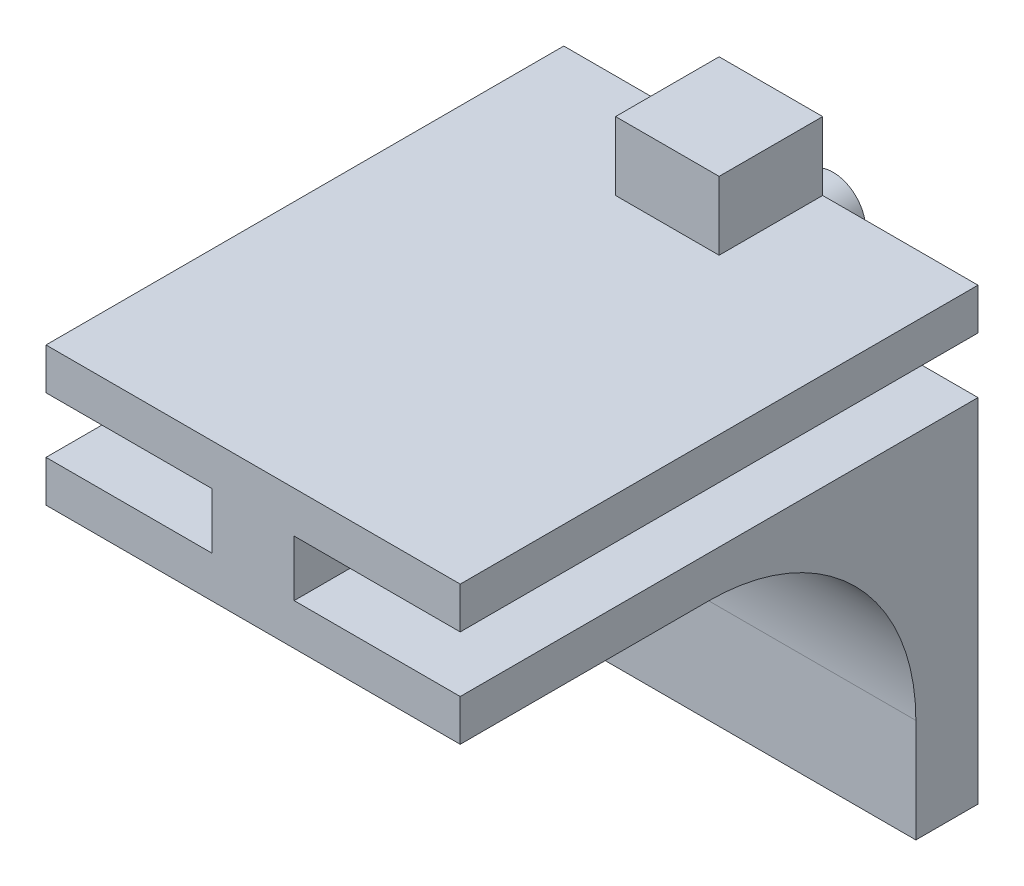
ISO-10303-21;
HEADER;
FILE_DESCRIPTION(('STEP AP214'),'2;1');
FILE_NAME('part.step','',(''),(''),'','','');
FILE_SCHEMA(('AUTOMOTIVE_DESIGN { 1 0 10303 214 1 1 1 1 }'));
ENDSEC;
DATA;
#1=APPLICATION_CONTEXT('core data for automotive mechanical design processes');
#2=APPLICATION_PROTOCOL_DEFINITION('international standard','automotive_design',2000,#1);
#3=PRODUCT_CONTEXT('',#1,'mechanical');
#4=PRODUCT('Part','Part','',(#3));
#5=PRODUCT_RELATED_PRODUCT_CATEGORY('part','',(#4));
#6=PRODUCT_DEFINITION_FORMATION('','',#4);
#7=PRODUCT_DEFINITION_CONTEXT('part definition',#1,'design');
#8=PRODUCT_DEFINITION('design','',#6,#7);
#9=PRODUCT_DEFINITION_SHAPE('','',#8);
#10=(LENGTH_UNIT() NAMED_UNIT(*) SI_UNIT(.MILLI.,.METRE.));
#11=(NAMED_UNIT(*) PLANE_ANGLE_UNIT() SI_UNIT($,.RADIAN.));
#12=(NAMED_UNIT(*) SI_UNIT($,.STERADIAN.) SOLID_ANGLE_UNIT());
#13=UNCERTAINTY_MEASURE_WITH_UNIT(LENGTH_MEASURE(1.E-05),#10,'distance_accuracy_value','');
#14=(GEOMETRIC_REPRESENTATION_CONTEXT(3) GLOBAL_UNCERTAINTY_ASSIGNED_CONTEXT((#13)) GLOBAL_UNIT_ASSIGNED_CONTEXT((#10,
#11,#12)) REPRESENTATION_CONTEXT('',''));
#15=CARTESIAN_POINT('',(0.,0.,0.));
#16=DIRECTION('',(0.,0.,1.));
#17=DIRECTION('',(1.,0.,0.));
#18=AXIS2_PLACEMENT_3D('',#15,#16,#17);
#19=CARTESIAN_POINT('',(10.,3.35,25.));
#20=DIRECTION('',(0.,-1.,0.));
#21=DIRECTION('',(0.,0.,-1.));
#22=AXIS2_PLACEMENT_3D('',#19,#20,#21);
#23=PLANE('',#22);
#24=DIRECTION('',(0.,0.,-1.));
#25=VECTOR('',#24,1.);
#26=CARTESIAN_POINT('',(2.5,3.35,5.));
#27=LINE('',#26,#25);
#28=CARTESIAN_POINT('',(2.5,3.35,5.));
#29=VERTEX_POINT('',#28);
#30=CARTESIAN_POINT('',(2.5,3.35,0.));
#31=VERTEX_POINT('',#30);
#32=EDGE_CURVE('E37',#29,#31,#27,.T.);
#33=ORIENTED_EDGE('',*,*,#32,.F.);
#34=DIRECTION('',(1.,0.,0.));
#35=VECTOR('',#34,1.);
#36=CARTESIAN_POINT('',(-2.5,3.35,5.));
#37=LINE('',#36,#35);
#38=CARTESIAN_POINT('',(-2.5,3.35,5.));
#39=VERTEX_POINT('',#38);
#40=EDGE_CURVE('E186',#39,#29,#37,.T.);
#41=ORIENTED_EDGE('',*,*,#40,.F.);
#42=DIRECTION('',(0.,0.,1.));
#43=VECTOR('',#42,1.);
#44=CARTESIAN_POINT('',(-2.5,3.35,5.));
#45=LINE('',#44,#43);
#46=CARTESIAN_POINT('',(-2.5,3.35,0.));
#47=VERTEX_POINT('',#46);
#48=EDGE_CURVE('E56',#47,#39,#45,.T.);
#49=ORIENTED_EDGE('',*,*,#48,.F.);
#50=DIRECTION('',(-1.,0.,0.));
#51=VECTOR('',#50,1.);
#52=CARTESIAN_POINT('',(10.,3.35,0.));
#53=LINE('',#52,#51);
#54=CARTESIAN_POINT('',(-10.,3.35,0.));
#55=VERTEX_POINT('',#54);
#56=EDGE_CURVE('E203',#47,#55,#53,.T.);
#57=ORIENTED_EDGE('',*,*,#56,.T.);
#58=DIRECTION('',(0.,0.,-1.));
#59=VECTOR('',#58,1.);
#60=CARTESIAN_POINT('',(-10.,3.35,25.));
#61=LINE('',#60,#59);
#62=CARTESIAN_POINT('',(-10.,3.35,25.));
#63=VERTEX_POINT('',#62);
#64=EDGE_CURVE('E235',#63,#55,#61,.T.);
#65=ORIENTED_EDGE('',*,*,#64,.F.);
#66=DIRECTION('',(-1.,0.,0.));
#67=VECTOR('',#66,1.);
#68=CARTESIAN_POINT('',(10.,3.35,25.));
#69=LINE('',#68,#67);
#70=CARTESIAN_POINT('',(10.,3.35,25.));
#71=VERTEX_POINT('',#70);
#72=EDGE_CURVE('E325',#71,#63,#69,.T.);
#73=ORIENTED_EDGE('',*,*,#72,.F.);
#74=DIRECTION('',(0.,0.,-1.));
#75=VECTOR('',#74,1.);
#76=CARTESIAN_POINT('',(10.,3.35,25.));
#77=LINE('',#76,#75);
#78=CARTESIAN_POINT('',(10.,3.35,0.));
#79=VERTEX_POINT('',#78);
#80=EDGE_CURVE('E238',#71,#79,#77,.T.);
#81=ORIENTED_EDGE('',*,*,#80,.T.);
#82=EDGE_CURVE('E206',#79,#31,#53,.T.);
#83=ORIENTED_EDGE('',*,*,#82,.T.);
#84=EDGE_LOOP('',(#33,#41,#49,#57,#65,#73,#81,#83));
#85=FACE_BOUND('',#84,.T.);
#86=ADVANCED_FACE('F33',(#85),#23,.F.);
#87=CARTESIAN_POINT('',(0.,0.,0.));
#88=DIRECTION('',(0.,0.,-1.));
#89=DIRECTION('',(-1.,0.,0.));
#90=AXIS2_PLACEMENT_3D('',#87,#88,#89);
#91=PLANE('',#90);
#92=DIRECTION('',(0.,-1.,0.));
#93=VECTOR('',#92,1.);
#94=CARTESIAN_POINT('',(-10.,-3.35,0.));
#95=LINE('',#94,#93);
#96=CARTESIAN_POINT('',(-10.,-1.35,0.));
#97=VERTEX_POINT('',#96);
#98=CARTESIAN_POINT('',(-10.,-18.35,0.));
#99=VERTEX_POINT('',#98);
#100=EDGE_CURVE('E273',#97,#99,#95,.T.);
#101=ORIENTED_EDGE('',*,*,#100,.F.);
#102=DIRECTION('',(-1.,0.,0.));
#103=VECTOR('',#102,1.);
#104=CARTESIAN_POINT('',(-10.,-1.35,0.));
#105=LINE('',#104,#103);
#106=CARTESIAN_POINT('',(-1.9812,-1.35,0.));
#107=VERTEX_POINT('',#106);
#108=EDGE_CURVE('E219',#107,#97,#105,.T.);
#109=ORIENTED_EDGE('',*,*,#108,.F.);
#110=DIRECTION('',(0.,-1.,0.));
#111=VECTOR('',#110,1.);
#112=CARTESIAN_POINT('',(-1.9812,-1.35,0.));
#113=LINE('',#112,#111);
#114=CARTESIAN_POINT('',(-1.9812,1.35,0.));
#115=VERTEX_POINT('',#114);
#116=EDGE_CURVE('E217',#115,#107,#113,.T.);
#117=ORIENTED_EDGE('',*,*,#116,.F.);
#118=DIRECTION('',(1.,0.,0.));
#119=VECTOR('',#118,1.);
#120=CARTESIAN_POINT('',(-10.,1.35,0.));
#121=LINE('',#120,#119);
#122=CARTESIAN_POINT('',(-10.,1.35,0.));
#123=VERTEX_POINT('',#122);
#124=EDGE_CURVE('E215',#123,#115,#121,.T.);
#125=ORIENTED_EDGE('',*,*,#124,.F.);
#126=DIRECTION('',(0.,-1.,0.));
#127=VECTOR('',#126,1.);
#128=CARTESIAN_POINT('',(-10.,3.35,0.));
#129=LINE('',#128,#127);
#130=EDGE_CURVE('E212',#55,#123,#129,.T.);
#131=ORIENTED_EDGE('',*,*,#130,.F.);
#132=ORIENTED_EDGE('',*,*,#56,.F.);
#133=DIRECTION('',(0.,-1.,0.));
#134=VECTOR('',#133,1.);
#135=CARTESIAN_POINT('',(-2.5,6.65,0.));
#136=LINE('',#135,#134);
#137=CARTESIAN_POINT('',(-2.5,6.65,0.));
#138=VERTEX_POINT('',#137);
#139=EDGE_CURVE('E173',#138,#47,#136,.T.);
#140=ORIENTED_EDGE('',*,*,#139,.F.);
#141=DIRECTION('',(-1.,0.,0.));
#142=VECTOR('',#141,1.);
#143=CARTESIAN_POINT('',(-2.5,6.65,0.));
#144=LINE('',#143,#142);
#145=CARTESIAN_POINT('',(2.5,6.65,0.));
#146=VERTEX_POINT('',#145);
#147=EDGE_CURVE('E164',#146,#138,#144,.T.);
#148=ORIENTED_EDGE('',*,*,#147,.F.);
#149=DIRECTION('',(0.,-1.,0.));
#150=VECTOR('',#149,1.);
#151=CARTESIAN_POINT('',(2.5,6.65,0.));
#152=LINE('',#151,#150);
#153=EDGE_CURVE('E171',#146,#31,#152,.T.);
#154=ORIENTED_EDGE('',*,*,#153,.T.);
#155=ORIENTED_EDGE('',*,*,#82,.F.);
#156=DIRECTION('',(0.,1.,0.));
#157=VECTOR('',#156,1.);
#158=CARTESIAN_POINT('',(10.,3.35,0.));
#159=LINE('',#158,#157);
#160=CARTESIAN_POINT('',(10.,1.35,0.));
#161=VERTEX_POINT('',#160);
#162=EDGE_CURVE('E207',#161,#79,#159,.T.);
#163=ORIENTED_EDGE('',*,*,#162,.F.);
#164=DIRECTION('',(1.,0.,0.));
#165=VECTOR('',#164,1.);
#166=CARTESIAN_POINT('',(10.,1.35,0.));
#167=LINE('',#166,#165);
#168=CARTESIAN_POINT('',(1.9812,1.35,0.));
#169=VERTEX_POINT('',#168);
#170=EDGE_CURVE('E340',#169,#161,#167,.T.);
#171=ORIENTED_EDGE('',*,*,#170,.F.);
#172=DIRECTION('',(0.,1.,0.));
#173=VECTOR('',#172,1.);
#174=CARTESIAN_POINT('',(1.9812,-1.35,0.));
#175=LINE('',#174,#173);
#176=CARTESIAN_POINT('',(1.9812,-1.35,0.));
#177=VERTEX_POINT('',#176);
#178=EDGE_CURVE('E339',#177,#169,#175,.T.);
#179=ORIENTED_EDGE('',*,*,#178,.F.);
#180=DIRECTION('',(-1.,0.,0.));
#181=VECTOR('',#180,1.);
#182=CARTESIAN_POINT('',(10.,-1.35,0.));
#183=LINE('',#182,#181);
#184=CARTESIAN_POINT('',(10.,-1.35,0.));
#185=VERTEX_POINT('',#184);
#186=EDGE_CURVE('E337',#185,#177,#183,.T.);
#187=ORIENTED_EDGE('',*,*,#186,.F.);
#188=DIRECTION('',(0.,1.,0.));
#189=VECTOR('',#188,1.);
#190=CARTESIAN_POINT('',(10.,-3.35,0.));
#191=LINE('',#190,#189);
#192=CARTESIAN_POINT('',(10.,-18.35,0.));
#193=VERTEX_POINT('',#192);
#194=EDGE_CURVE('E335',#193,#185,#191,.T.);
#195=ORIENTED_EDGE('',*,*,#194,.F.);
#196=DIRECTION('',(1.,0.,0.));
#197=VECTOR('',#196,1.);
#198=CARTESIAN_POINT('',(10.,-18.35,0.));
#199=LINE('',#198,#197);
#200=EDGE_CURVE('E309',#99,#193,#199,.T.);
#201=ORIENTED_EDGE('',*,*,#200,.F.);
#202=EDGE_LOOP('',(#101,#109,#117,#125,#131,#132,#140,#148,#154,#155,#163,#171,#179,#187,#195,#201));
#203=FACE_BOUND('',#202,.T.);
#204=CARTESIAN_POINT('',(0.,0.,0.));
#205=DIRECTION('',(0.,0.,-1.));
#206=DIRECTION('',(-1.,0.,0.));
#207=AXIS2_PLACEMENT_3D('',#204,#205,#206);
#208=CIRCLE('',#207,1.5748);
#209=CARTESIAN_POINT('',(-1.5748,0.,0.));
#210=VERTEX_POINT('',#209);
#211=EDGE_CURVE('E189',#210,#210,#208,.T.);
#212=ORIENTED_EDGE('',*,*,#211,.F.);
#213=EDGE_LOOP('',(#212));
#214=FACE_BOUND('',#213,.T.);
#215=ADVANCED_FACE('F167',(#203,#214),#91,.T.);
#216=CARTESIAN_POINT('',(10.,-3.35,25.));
#217=DIRECTION('',(0.,1.,0.));
#218=DIRECTION('',(0.,0.,1.));
#219=AXIS2_PLACEMENT_3D('',#216,#217,#218);
#220=PLANE('',#219);
#221=DIRECTION('',(0.,0.,-1.));
#222=VECTOR('',#221,1.);
#223=CARTESIAN_POINT('',(-10.,-3.35,25.));
#224=LINE('',#223,#222);
#225=CARTESIAN_POINT('',(-10.,-3.35,25.));
#226=VERTEX_POINT('',#225);
#227=CARTESIAN_POINT('',(-10.,-3.35,13.));
#228=VERTEX_POINT('',#227);
#229=EDGE_CURVE('E260',#226,#228,#224,.T.);
#230=ORIENTED_EDGE('',*,*,#229,.T.);
#231=DIRECTION('',(-1.,0.,0.));
#232=VECTOR('',#231,1.);
#233=CARTESIAN_POINT('',(10.,-3.35,13.));
#234=LINE('',#233,#232);
#235=CARTESIAN_POINT('',(10.,-3.35,13.));
#236=VERTEX_POINT('',#235);
#237=EDGE_CURVE('E278',#228,#236,#234,.F.);
#238=ORIENTED_EDGE('',*,*,#237,.T.);
#239=DIRECTION('',(0.,0.,-1.));
#240=VECTOR('',#239,1.);
#241=CARTESIAN_POINT('',(10.,-3.35,25.));
#242=LINE('',#241,#240);
#243=CARTESIAN_POINT('',(10.,-3.35,25.));
#244=VERTEX_POINT('',#243);
#245=EDGE_CURVE('E253',#244,#236,#242,.T.);
#246=ORIENTED_EDGE('',*,*,#245,.F.);
#247=DIRECTION('',(1.,0.,0.));
#248=VECTOR('',#247,1.);
#249=CARTESIAN_POINT('',(10.,-3.35,25.));
#250=LINE('',#249,#248);
#251=EDGE_CURVE('E292',#226,#244,#250,.T.);
#252=ORIENTED_EDGE('',*,*,#251,.F.);
#253=EDGE_LOOP('',(#230,#238,#246,#252));
#254=FACE_BOUND('',#253,.T.);
#255=ADVANCED_FACE('F290',(#254),#220,.F.);
#256=CARTESIAN_POINT('',(-10.,-3.35,25.));
#257=DIRECTION('',(1.,0.,0.));
#258=DIRECTION('',(0.,0.,-1.));
#259=AXIS2_PLACEMENT_3D('',#256,#257,#258);
#260=PLANE('',#259);
#261=ORIENTED_EDGE('',*,*,#100,.T.);
#262=DIRECTION('',(0.,0.,-1.));
#263=VECTOR('',#262,1.);
#264=CARTESIAN_POINT('',(-10.,-18.35,0.));
#265=LINE('',#264,#263);
#266=CARTESIAN_POINT('',(-10.,-18.35,3.));
#267=VERTEX_POINT('',#266);
#268=EDGE_CURVE('E268',#267,#99,#265,.T.);
#269=ORIENTED_EDGE('',*,*,#268,.F.);
#270=DIRECTION('',(0.,1.,0.));
#271=VECTOR('',#270,1.);
#272=CARTESIAN_POINT('',(-10.,-18.35,3.));
#273=LINE('',#272,#271);
#274=CARTESIAN_POINT('',(-10.,-13.35,3.));
#275=VERTEX_POINT('',#274);
#276=EDGE_CURVE('E264',#267,#275,#273,.T.);
#277=ORIENTED_EDGE('',*,*,#276,.T.);
#278=CARTESIAN_POINT('',(-10.,-13.35,13.));
#279=DIRECTION('',(1.,0.,0.));
#280=DIRECTION('',(0.,0.,-1.));
#281=AXIS2_PLACEMENT_3D('',#278,#279,#280);
#282=CIRCLE('',#281,10.);
#283=EDGE_CURVE('E43',#275,#228,#282,.T.);
#284=ORIENTED_EDGE('',*,*,#283,.T.);
#285=ORIENTED_EDGE('',*,*,#229,.F.);
#286=DIRECTION('',(0.,-1.,0.));
#287=VECTOR('',#286,1.);
#288=CARTESIAN_POINT('',(-10.,-3.35,25.));
#289=LINE('',#288,#287);
#290=CARTESIAN_POINT('',(-10.,-1.35,25.));
#291=VERTEX_POINT('',#290);
#292=EDGE_CURVE('E221',#291,#226,#289,.T.);
#293=ORIENTED_EDGE('',*,*,#292,.F.);
#294=DIRECTION('',(0.,0.,-1.));
#295=VECTOR('',#294,1.);
#296=CARTESIAN_POINT('',(-10.,-1.35,25.));
#297=LINE('',#296,#295);
#298=EDGE_CURVE('E222',#291,#97,#297,.T.);
#299=ORIENTED_EDGE('',*,*,#298,.T.);
#300=EDGE_LOOP('',(#261,#269,#277,#284,#285,#293,#299));
#301=FACE_BOUND('',#300,.T.);
#302=ADVANCED_FACE('F282',(#301),#260,.F.);
#303=CARTESIAN_POINT('',(10.,-3.35,25.));
#304=DIRECTION('',(-1.,0.,0.));
#305=DIRECTION('',(0.,-1.,0.));
#306=AXIS2_PLACEMENT_3D('',#303,#304,#305);
#307=PLANE('',#306);
#308=ORIENTED_EDGE('',*,*,#194,.T.);
#309=DIRECTION('',(0.,0.,-1.));
#310=VECTOR('',#309,1.);
#311=CARTESIAN_POINT('',(10.,-1.35,25.));
#312=LINE('',#311,#310);
#313=CARTESIAN_POINT('',(10.,-1.35,25.));
#314=VERTEX_POINT('',#313);
#315=EDGE_CURVE('E250',#314,#185,#312,.T.);
#316=ORIENTED_EDGE('',*,*,#315,.F.);
#317=DIRECTION('',(0.,1.,0.));
#318=VECTOR('',#317,1.);
#319=CARTESIAN_POINT('',(10.,-3.35,25.));
#320=LINE('',#319,#318);
#321=EDGE_CURVE('E315',#244,#314,#320,.T.);
#322=ORIENTED_EDGE('',*,*,#321,.F.);
#323=ORIENTED_EDGE('',*,*,#245,.T.);
#324=CARTESIAN_POINT('',(9.99999999999997,-13.35,13.));
#325=DIRECTION('',(-1.,0.,0.));
#326=DIRECTION('',(0.,-1.,0.));
#327=AXIS2_PLACEMENT_3D('',#324,#325,#326);
#328=CIRCLE('',#327,10.);
#329=CARTESIAN_POINT('',(10.,-13.35,3.));
#330=VERTEX_POINT('',#329);
#331=EDGE_CURVE('E11',#236,#330,#328,.T.);
#332=ORIENTED_EDGE('',*,*,#331,.T.);
#333=DIRECTION('',(0.,1.,0.));
#334=VECTOR('',#333,1.);
#335=CARTESIAN_POINT('',(10.,-18.35,3.));
#336=LINE('',#335,#334);
#337=CARTESIAN_POINT('',(10.,-18.35,3.));
#338=VERTEX_POINT('',#337);
#339=EDGE_CURVE('E267',#338,#330,#336,.T.);
#340=ORIENTED_EDGE('',*,*,#339,.F.);
#341=DIRECTION('',(0.,0.,1.));
#342=VECTOR('',#341,1.);
#343=CARTESIAN_POINT('',(10.,-18.35,3.));
#344=LINE('',#343,#342);
#345=EDGE_CURVE('E306',#193,#338,#344,.T.);
#346=ORIENTED_EDGE('',*,*,#345,.F.);
#347=EDGE_LOOP('',(#308,#316,#322,#323,#332,#340,#346));
#348=FACE_BOUND('',#347,.T.);
#349=ADVANCED_FACE('F297',(#348),#307,.F.);
#350=CARTESIAN_POINT('',(10.,-1.35,25.));
#351=DIRECTION('',(0.,-1.,0.));
#352=DIRECTION('',(1.,0.,0.));
#353=AXIS2_PLACEMENT_3D('',#350,#351,#352);
#354=PLANE('',#353);
#355=ORIENTED_EDGE('',*,*,#186,.T.);
#356=DIRECTION('',(0.,0.,-1.));
#357=VECTOR('',#356,1.);
#358=CARTESIAN_POINT('',(1.9812,-1.35,25.));
#359=LINE('',#358,#357);
#360=CARTESIAN_POINT('',(1.9812,-1.35,25.));
#361=VERTEX_POINT('',#360);
#362=EDGE_CURVE('E247',#361,#177,#359,.T.);
#363=ORIENTED_EDGE('',*,*,#362,.F.);
#364=DIRECTION('',(-1.,0.,0.));
#365=VECTOR('',#364,1.);
#366=CARTESIAN_POINT('',(10.,-1.35,25.));
#367=LINE('',#366,#365);
#368=EDGE_CURVE('E317',#314,#361,#367,.T.);
#369=ORIENTED_EDGE('',*,*,#368,.F.);
#370=ORIENTED_EDGE('',*,*,#315,.T.);
#371=EDGE_LOOP('',(#355,#363,#369,#370));
#372=FACE_BOUND('',#371,.T.);
#373=ADVANCED_FACE('F368',(#372),#354,.F.);
#374=CARTESIAN_POINT('',(1.9812,-1.35,25.));
#375=DIRECTION('',(-1.,0.,0.));
#376=DIRECTION('',(0.,0.,1.));
#377=AXIS2_PLACEMENT_3D('',#374,#375,#376);
#378=PLANE('',#377);
#379=ORIENTED_EDGE('',*,*,#178,.T.);
#380=DIRECTION('',(0.,0.,-1.));
#381=VECTOR('',#380,1.);
#382=CARTESIAN_POINT('',(1.9812,1.35,25.));
#383=LINE('',#382,#381);
#384=CARTESIAN_POINT('',(1.9812,1.35,25.));
#385=VERTEX_POINT('',#384);
#386=EDGE_CURVE('E244',#385,#169,#383,.T.);
#387=ORIENTED_EDGE('',*,*,#386,.F.);
#388=DIRECTION('',(0.,1.,0.));
#389=VECTOR('',#388,1.);
#390=CARTESIAN_POINT('',(1.9812,-1.35,25.));
#391=LINE('',#390,#389);
#392=EDGE_CURVE('E319',#361,#385,#391,.T.);
#393=ORIENTED_EDGE('',*,*,#392,.F.);
#394=ORIENTED_EDGE('',*,*,#362,.T.);
#395=EDGE_LOOP('',(#379,#387,#393,#394));
#396=FACE_BOUND('',#395,.T.);
#397=ADVANCED_FACE('F360',(#396),#378,.F.);
#398=CARTESIAN_POINT('',(10.,1.35,25.));
#399=DIRECTION('',(0.,1.,0.));
#400=DIRECTION('',(-1.,0.,0.));
#401=AXIS2_PLACEMENT_3D('',#398,#399,#400);
#402=PLANE('',#401);
#403=ORIENTED_EDGE('',*,*,#170,.T.);
#404=DIRECTION('',(0.,0.,-1.));
#405=VECTOR('',#404,1.);
#406=CARTESIAN_POINT('',(10.,1.35,25.));
#407=LINE('',#406,#405);
#408=CARTESIAN_POINT('',(10.,1.35,25.));
#409=VERTEX_POINT('',#408);
#410=EDGE_CURVE('E241',#409,#161,#407,.T.);
#411=ORIENTED_EDGE('',*,*,#410,.F.);
#412=DIRECTION('',(1.,0.,0.));
#413=VECTOR('',#412,1.);
#414=CARTESIAN_POINT('',(10.,1.35,25.));
#415=LINE('',#414,#413);
#416=EDGE_CURVE('E321',#385,#409,#415,.T.);
#417=ORIENTED_EDGE('',*,*,#416,.F.);
#418=ORIENTED_EDGE('',*,*,#386,.T.);
#419=EDGE_LOOP('',(#403,#411,#417,#418));
#420=FACE_BOUND('',#419,.T.);
#421=ADVANCED_FACE('F358',(#420),#402,.F.);
#422=CARTESIAN_POINT('',(10.,3.35,25.));
#423=DIRECTION('',(-1.,0.,0.));
#424=DIRECTION('',(0.,-1.,0.));
#425=AXIS2_PLACEMENT_3D('',#422,#423,#424);
#426=PLANE('',#425);
#427=ORIENTED_EDGE('',*,*,#162,.T.);
#428=ORIENTED_EDGE('',*,*,#80,.F.);
#429=DIRECTION('',(0.,1.,0.));
#430=VECTOR('',#429,1.);
#431=CARTESIAN_POINT('',(10.,3.35,25.));
#432=LINE('',#431,#430);
#433=EDGE_CURVE('E323',#409,#71,#432,.T.);
#434=ORIENTED_EDGE('',*,*,#433,.F.);
#435=ORIENTED_EDGE('',*,*,#410,.T.);
#436=EDGE_LOOP('',(#427,#428,#434,#435));
#437=FACE_BOUND('',#436,.T.);
#438=ADVANCED_FACE('F347',(#437),#426,.F.);
#439=CARTESIAN_POINT('',(-10.,3.35,25.));
#440=DIRECTION('',(1.,0.,0.));
#441=DIRECTION('',(0.,0.,-1.));
#442=AXIS2_PLACEMENT_3D('',#439,#440,#441);
#443=PLANE('',#442);
#444=ORIENTED_EDGE('',*,*,#130,.T.);
#445=DIRECTION('',(0.,0.,-1.));
#446=VECTOR('',#445,1.);
#447=CARTESIAN_POINT('',(-10.,1.35,25.));
#448=LINE('',#447,#446);
#449=CARTESIAN_POINT('',(-10.,1.35,25.));
#450=VERTEX_POINT('',#449);
#451=EDGE_CURVE('E232',#450,#123,#448,.T.);
#452=ORIENTED_EDGE('',*,*,#451,.F.);
#453=DIRECTION('',(0.,-1.,0.));
#454=VECTOR('',#453,1.);
#455=CARTESIAN_POINT('',(-10.,3.35,25.));
#456=LINE('',#455,#454);
#457=EDGE_CURVE('E327',#63,#450,#456,.T.);
#458=ORIENTED_EDGE('',*,*,#457,.F.);
#459=ORIENTED_EDGE('',*,*,#64,.T.);
#460=EDGE_LOOP('',(#444,#452,#458,#459));
#461=FACE_BOUND('',#460,.T.);
#462=ADVANCED_FACE('F366',(#461),#443,.F.);
#463=CARTESIAN_POINT('',(-10.,1.35,25.));
#464=DIRECTION('',(0.,1.,0.));
#465=DIRECTION('',(0.,0.,1.));
#466=AXIS2_PLACEMENT_3D('',#463,#464,#465);
#467=PLANE('',#466);
#468=ORIENTED_EDGE('',*,*,#124,.T.);
#469=DIRECTION('',(0.,0.,-1.));
#470=VECTOR('',#469,1.);
#471=CARTESIAN_POINT('',(-1.9812,1.35,25.));
#472=LINE('',#471,#470);
#473=CARTESIAN_POINT('',(-1.9812,1.35,25.));
#474=VERTEX_POINT('',#473);
#475=EDGE_CURVE('E229',#474,#115,#472,.T.);
#476=ORIENTED_EDGE('',*,*,#475,.F.);
#477=DIRECTION('',(1.,0.,0.));
#478=VECTOR('',#477,1.);
#479=CARTESIAN_POINT('',(-10.,1.35,25.));
#480=LINE('',#479,#478);
#481=EDGE_CURVE('E329',#450,#474,#480,.T.);
#482=ORIENTED_EDGE('',*,*,#481,.F.);
#483=ORIENTED_EDGE('',*,*,#451,.T.);
#484=EDGE_LOOP('',(#468,#476,#482,#483));
#485=FACE_BOUND('',#484,.T.);
#486=ADVANCED_FACE('F382',(#485),#467,.F.);
#487=CARTESIAN_POINT('',(-1.9812,-1.35,25.));
#488=DIRECTION('',(1.,0.,0.));
#489=DIRECTION('',(0.,0.,-1.));
#490=AXIS2_PLACEMENT_3D('',#487,#488,#489);
#491=PLANE('',#490);
#492=ORIENTED_EDGE('',*,*,#116,.T.);
#493=DIRECTION('',(0.,0.,-1.));
#494=VECTOR('',#493,1.);
#495=CARTESIAN_POINT('',(-1.9812,-1.35,25.));
#496=LINE('',#495,#494);
#497=CARTESIAN_POINT('',(-1.9812,-1.35,25.));
#498=VERTEX_POINT('',#497);
#499=EDGE_CURVE('E225',#498,#107,#496,.T.);
#500=ORIENTED_EDGE('',*,*,#499,.F.);
#501=DIRECTION('',(0.,-1.,0.));
#502=VECTOR('',#501,1.);
#503=CARTESIAN_POINT('',(-1.9812,-1.35,25.));
#504=LINE('',#503,#502);
#505=EDGE_CURVE('E331',#474,#498,#504,.T.);
#506=ORIENTED_EDGE('',*,*,#505,.F.);
#507=ORIENTED_EDGE('',*,*,#475,.T.);
#508=EDGE_LOOP('',(#492,#500,#506,#507));
#509=FACE_BOUND('',#508,.T.);
#510=ADVANCED_FACE('F386',(#509),#491,.F.);
#511=CARTESIAN_POINT('',(-10.,-1.35,25.));
#512=DIRECTION('',(0.,-1.,0.));
#513=DIRECTION('',(0.,0.,-1.));
#514=AXIS2_PLACEMENT_3D('',#511,#512,#513);
#515=PLANE('',#514);
#516=ORIENTED_EDGE('',*,*,#108,.T.);
#517=ORIENTED_EDGE('',*,*,#298,.F.);
#518=DIRECTION('',(-1.,0.,0.));
#519=VECTOR('',#518,1.);
#520=CARTESIAN_POINT('',(-10.,-1.35,25.));
#521=LINE('',#520,#519);
#522=EDGE_CURVE('E226',#498,#291,#521,.T.);
#523=ORIENTED_EDGE('',*,*,#522,.F.);
#524=ORIENTED_EDGE('',*,*,#499,.T.);
#525=EDGE_LOOP('',(#516,#517,#523,#524));
#526=FACE_BOUND('',#525,.T.);
#527=ADVANCED_FACE('F390',(#526),#515,.F.);
#528=CARTESIAN_POINT('',(0.,0.,25.));
#529=DIRECTION('',(0.,0.,-1.));
#530=DIRECTION('',(-1.,0.,0.));
#531=AXIS2_PLACEMENT_3D('',#528,#529,#530);
#532=PLANE('',#531);
#533=ORIENTED_EDGE('',*,*,#292,.T.);
#534=ORIENTED_EDGE('',*,*,#251,.T.);
#535=ORIENTED_EDGE('',*,*,#321,.T.);
#536=ORIENTED_EDGE('',*,*,#368,.T.);
#537=ORIENTED_EDGE('',*,*,#392,.T.);
#538=ORIENTED_EDGE('',*,*,#416,.T.);
#539=ORIENTED_EDGE('',*,*,#433,.T.);
#540=ORIENTED_EDGE('',*,*,#72,.T.);
#541=ORIENTED_EDGE('',*,*,#457,.T.);
#542=ORIENTED_EDGE('',*,*,#481,.T.);
#543=ORIENTED_EDGE('',*,*,#505,.T.);
#544=ORIENTED_EDGE('',*,*,#522,.T.);
#545=EDGE_LOOP('',(#533,#534,#535,#536,#537,#538,#539,#540,#541,#542,#543,#544));
#546=FACE_BOUND('',#545,.T.);
#547=ADVANCED_FACE('F353',(#546),#532,.F.);
#548=CARTESIAN_POINT('',(-10.,-18.35,3.));
#549=DIRECTION('',(0.,0.,-1.));
#550=DIRECTION('',(-1.,0.,0.));
#551=AXIS2_PLACEMENT_3D('',#548,#549,#550);
#552=PLANE('',#551);
#553=ORIENTED_EDGE('',*,*,#339,.T.);
#554=DIRECTION('',(-1.,0.,0.));
#555=VECTOR('',#554,1.);
#556=CARTESIAN_POINT('',(-10.,-13.35,3.));
#557=LINE('',#556,#555);
#558=EDGE_CURVE('E263',#330,#275,#557,.T.);
#559=ORIENTED_EDGE('',*,*,#558,.T.);
#560=ORIENTED_EDGE('',*,*,#276,.F.);
#561=DIRECTION('',(-1.,0.,0.));
#562=VECTOR('',#561,1.);
#563=CARTESIAN_POINT('',(-10.,-18.35,3.));
#564=LINE('',#563,#562);
#565=EDGE_CURVE('E303',#338,#267,#564,.T.);
#566=ORIENTED_EDGE('',*,*,#565,.F.);
#567=EDGE_LOOP('',(#553,#559,#560,#566));
#568=FACE_BOUND('',#567,.T.);
#569=ADVANCED_FACE('F302',(#568),#552,.F.);
#570=CARTESIAN_POINT('',(0.,-18.35,0.));
#571=DIRECTION('',(0.,1.,0.));
#572=DIRECTION('',(0.,0.,1.));
#573=AXIS2_PLACEMENT_3D('',#570,#571,#572);
#574=PLANE('',#573);
#575=ORIENTED_EDGE('',*,*,#200,.T.);
#576=ORIENTED_EDGE('',*,*,#345,.T.);
#577=ORIENTED_EDGE('',*,*,#565,.T.);
#578=ORIENTED_EDGE('',*,*,#268,.T.);
#579=EDGE_LOOP('',(#575,#576,#577,#578));
#580=FACE_BOUND('',#579,.T.);
#581=ADVANCED_FACE('F399',(#580),#574,.F.);
#582=CARTESIAN_POINT('',(-10.,-13.35,13.));
#583=DIRECTION('',(1.,0.,0.));
#584=DIRECTION('',(0.,0.,-1.));
#585=AXIS2_PLACEMENT_3D('',#582,#583,#584);
#586=CYLINDRICAL_SURFACE('',#585,10.);
#587=ORIENTED_EDGE('',*,*,#331,.F.);
#588=ORIENTED_EDGE('',*,*,#237,.F.);
#589=ORIENTED_EDGE('',*,*,#283,.F.);
#590=ORIENTED_EDGE('',*,*,#558,.F.);
#591=EDGE_LOOP('',(#587,#588,#589,#590));
#592=FACE_BOUND('',#591,.T.);
#593=ADVANCED_FACE('F35',(#592),#586,.F.);
#594=CARTESIAN_POINT('',(0.,0.,-3.));
#595=DIRECTION('',(0.,0.,1.));
#596=DIRECTION('',(1.,0.,0.));
#597=AXIS2_PLACEMENT_3D('',#594,#595,#596);
#598=CYLINDRICAL_SURFACE('',#597,1.5748);
#599=CARTESIAN_POINT('',(0.,0.,-3.));
#600=DIRECTION('',(0.,0.,-1.));
#601=DIRECTION('',(-1.,0.,0.));
#602=AXIS2_PLACEMENT_3D('',#599,#600,#601);
#603=CIRCLE('',#602,1.5748);
#604=CARTESIAN_POINT('',(-1.5748,0.,-3.));
#605=VERTEX_POINT('',#604);
#606=EDGE_CURVE('E192',#605,#605,#603,.T.);
#607=ORIENTED_EDGE('',*,*,#606,.F.);
#608=EDGE_LOOP('',(#607));
#609=FACE_BOUND('',#608,.T.);
#610=ORIENTED_EDGE('',*,*,#211,.T.);
#611=EDGE_LOOP('',(#610));
#612=FACE_BOUND('',#611,.T.);
#613=ADVANCED_FACE('F402',(#609,#612),#598,.T.);
#614=CARTESIAN_POINT('',(0.,0.,-3.));
#615=DIRECTION('',(0.,0.,-1.));
#616=DIRECTION('',(-1.,0.,0.));
#617=AXIS2_PLACEMENT_3D('',#614,#615,#616);
#618=PLANE('',#617);
#619=ORIENTED_EDGE('',*,*,#606,.T.);
#620=EDGE_LOOP('',(#619));
#621=FACE_BOUND('',#620,.T.);
#622=ADVANCED_FACE('F405',(#621),#618,.T.);
#623=CARTESIAN_POINT('',(2.5,6.65,5.));
#624=DIRECTION('',(-1.,0.,0.));
#625=DIRECTION('',(0.,0.,1.));
#626=AXIS2_PLACEMENT_3D('',#623,#624,#625);
#627=PLANE('',#626);
#628=ORIENTED_EDGE('',*,*,#32,.T.);
#629=ORIENTED_EDGE('',*,*,#153,.F.);
#630=DIRECTION('',(0.,0.,-1.));
#631=VECTOR('',#630,1.);
#632=CARTESIAN_POINT('',(2.5,6.65,5.));
#633=LINE('',#632,#631);
#634=CARTESIAN_POINT('',(2.5,6.65,5.));
#635=VERTEX_POINT('',#634);
#636=EDGE_CURVE('E177',#635,#146,#633,.T.);
#637=ORIENTED_EDGE('',*,*,#636,.F.);
#638=DIRECTION('',(0.,-1.,0.));
#639=VECTOR('',#638,1.);
#640=CARTESIAN_POINT('',(2.5,6.65,5.));
#641=LINE('',#640,#639);
#642=EDGE_CURVE('E586',#635,#29,#641,.T.);
#643=ORIENTED_EDGE('',*,*,#642,.T.);
#644=EDGE_LOOP('',(#628,#629,#637,#643));
#645=FACE_BOUND('',#644,.T.);
#646=ADVANCED_FACE('F188',(#645),#627,.F.);
#647=CARTESIAN_POINT('',(-2.5,6.65,5.));
#648=DIRECTION('',(1.,0.,0.));
#649=DIRECTION('',(0.,0.,-1.));
#650=AXIS2_PLACEMENT_3D('',#647,#648,#649);
#651=PLANE('',#650);
#652=ORIENTED_EDGE('',*,*,#48,.T.);
#653=DIRECTION('',(0.,-1.,0.));
#654=VECTOR('',#653,1.);
#655=CARTESIAN_POINT('',(-2.5,6.65,5.));
#656=LINE('',#655,#654);
#657=CARTESIAN_POINT('',(-2.5,6.65,5.));
#658=VERTEX_POINT('',#657);
#659=EDGE_CURVE('E194',#658,#39,#656,.T.);
#660=ORIENTED_EDGE('',*,*,#659,.F.);
#661=DIRECTION('',(0.,0.,1.));
#662=VECTOR('',#661,1.);
#663=CARTESIAN_POINT('',(-2.5,6.65,5.));
#664=LINE('',#663,#662);
#665=EDGE_CURVE('E176',#138,#658,#664,.T.);
#666=ORIENTED_EDGE('',*,*,#665,.F.);
#667=ORIENTED_EDGE('',*,*,#139,.T.);
#668=EDGE_LOOP('',(#652,#660,#666,#667));
#669=FACE_BOUND('',#668,.T.);
#670=ADVANCED_FACE('F412',(#669),#651,.F.);
#671=CARTESIAN_POINT('',(-2.5,6.65,5.));
#672=DIRECTION('',(0.,0.,-1.));
#673=DIRECTION('',(-1.,0.,0.));
#674=AXIS2_PLACEMENT_3D('',#671,#672,#673);
#675=PLANE('',#674);
#676=ORIENTED_EDGE('',*,*,#40,.T.);
#677=ORIENTED_EDGE('',*,*,#642,.F.);
#678=DIRECTION('',(1.,0.,0.));
#679=VECTOR('',#678,1.);
#680=CARTESIAN_POINT('',(-2.5,6.65,5.));
#681=LINE('',#680,#679);
#682=EDGE_CURVE('E182',#658,#635,#681,.T.);
#683=ORIENTED_EDGE('',*,*,#682,.F.);
#684=ORIENTED_EDGE('',*,*,#659,.T.);
#685=EDGE_LOOP('',(#676,#677,#683,#684));
#686=FACE_BOUND('',#685,.T.);
#687=ADVANCED_FACE('F415',(#686),#675,.F.);
#688=CARTESIAN_POINT('',(0.,6.65,0.));
#689=DIRECTION('',(0.,-1.,0.));
#690=DIRECTION('',(0.,0.,-1.));
#691=AXIS2_PLACEMENT_3D('',#688,#689,#690);
#692=PLANE('',#691);
#693=ORIENTED_EDGE('',*,*,#636,.T.);
#694=ORIENTED_EDGE('',*,*,#147,.T.);
#695=ORIENTED_EDGE('',*,*,#665,.T.);
#696=ORIENTED_EDGE('',*,*,#682,.T.);
#697=EDGE_LOOP('',(#693,#694,#695,#696));
#698=FACE_BOUND('',#697,.T.);
#699=ADVANCED_FACE('F180',(#698),#692,.F.);
#700=CLOSED_SHELL('',(#86,#215,#255,#302,#349,#373,#397,#421,#438,#462,#486,#510,#527,#547,#569,
#581,#593,#613,#622,#646,#670,#687,#699));
#701=MANIFOLD_SOLID_BREP('B2',#700);
#702=ADVANCED_BREP_SHAPE_REPRESENTATION('',(#18,#701),#14);
#703=SHAPE_DEFINITION_REPRESENTATION(#9,#702);
ENDSEC;
END-ISO-10303-21;
